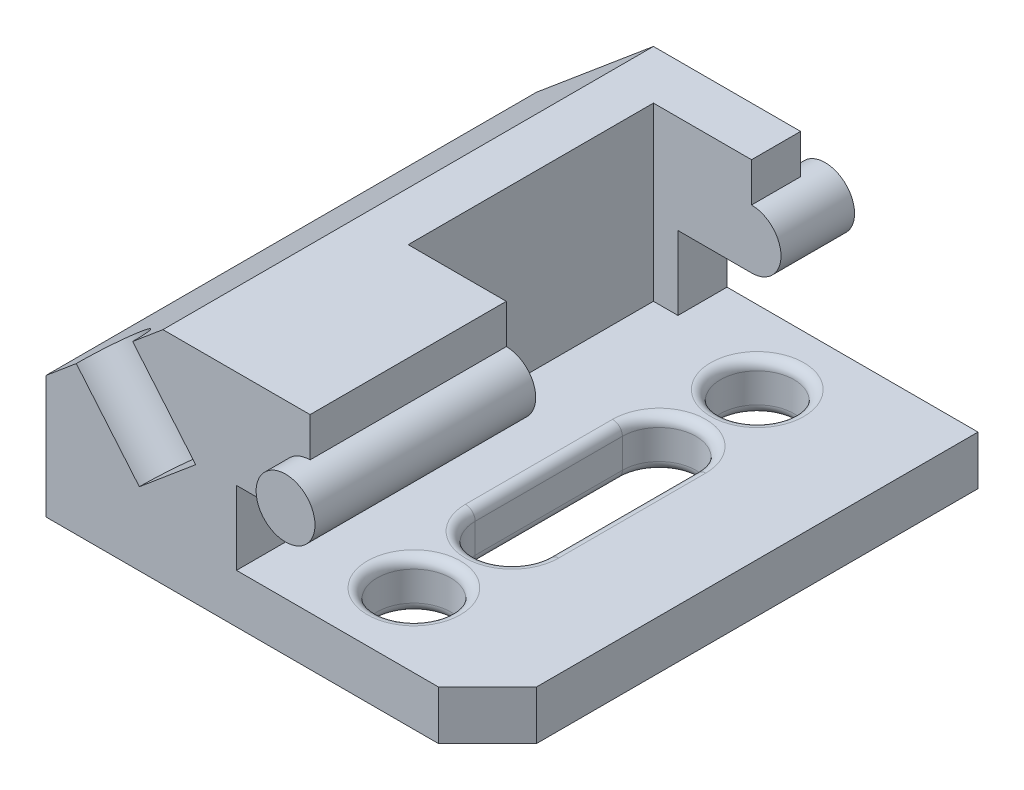
ISO-10303-21;
HEADER;
FILE_DESCRIPTION(('STEP AP214'),'2;1');
FILE_NAME('part.step','',(''),(''),'','','');
FILE_SCHEMA(('AUTOMOTIVE_DESIGN { 1 0 10303 214 1 1 1 1 }'));
ENDSEC;
DATA;
#1=APPLICATION_CONTEXT('core data for automotive mechanical design processes');
#2=APPLICATION_PROTOCOL_DEFINITION('international standard','automotive_design',2000,#1);
#3=PRODUCT_CONTEXT('',#1,'mechanical');
#4=PRODUCT('Part','Part','',(#3));
#5=PRODUCT_RELATED_PRODUCT_CATEGORY('part','',(#4));
#6=PRODUCT_DEFINITION_FORMATION('','',#4);
#7=PRODUCT_DEFINITION_CONTEXT('part definition',#1,'design');
#8=PRODUCT_DEFINITION('design','',#6,#7);
#9=PRODUCT_DEFINITION_SHAPE('','',#8);
#10=(LENGTH_UNIT() NAMED_UNIT(*) SI_UNIT(.MILLI.,.METRE.));
#11=(NAMED_UNIT(*) PLANE_ANGLE_UNIT() SI_UNIT($,.RADIAN.));
#12=(NAMED_UNIT(*) SI_UNIT($,.STERADIAN.) SOLID_ANGLE_UNIT());
#13=UNCERTAINTY_MEASURE_WITH_UNIT(LENGTH_MEASURE(1.E-05),#10,'distance_accuracy_value','');
#14=(GEOMETRIC_REPRESENTATION_CONTEXT(3) GLOBAL_UNCERTAINTY_ASSIGNED_CONTEXT((#13)) GLOBAL_UNIT_ASSIGNED_CONTEXT((#10,
#11,#12)) REPRESENTATION_CONTEXT('',''));
#15=CARTESIAN_POINT('',(0.,0.,0.));
#16=DIRECTION('',(0.,0.,1.));
#17=DIRECTION('',(1.,0.,0.));
#18=AXIS2_PLACEMENT_3D('',#15,#16,#17);
#19=CARTESIAN_POINT('',(38.8350718518843,9.99999999999999,100.));
#20=DIRECTION('',(-1.,0.,0.));
#21=DIRECTION('',(0.,0.,1.));
#22=AXIS2_PLACEMENT_3D('',#19,#20,#21);
#23=PLANE('',#22);
#24=DIRECTION('',(0.,0.,-1.));
#25=VECTOR('',#24,1.);
#26=CARTESIAN_POINT('',(38.8350718518843,9.99999999999999,100.));
#27=LINE('',#26,#25);
#28=CARTESIAN_POINT('',(38.8350718518843,9.99999999999999,100.));
#29=VERTEX_POINT('',#28);
#30=CARTESIAN_POINT('',(38.8350718518843,9.99999999999999,60.));
#31=VERTEX_POINT('',#30);
#32=EDGE_CURVE('E322',#29,#31,#27,.T.);
#33=ORIENTED_EDGE('',*,*,#32,.T.);
#34=DIRECTION('',(0.,1.,0.));
#35=VECTOR('',#34,1.);
#36=CARTESIAN_POINT('',(38.8350718518843,9.99999999999999,60.));
#37=LINE('',#36,#35);
#38=CARTESIAN_POINT('',(38.8350718518843,25.,60.));
#39=VERTEX_POINT('',#38);
#40=EDGE_CURVE('E576',#31,#39,#37,.T.);
#41=ORIENTED_EDGE('',*,*,#40,.T.);
#42=DIRECTION('',(0.,0.,-1.));
#43=VECTOR('',#42,1.);
#44=CARTESIAN_POINT('',(38.8350718518843,25.,100.));
#45=LINE('',#44,#43);
#46=CARTESIAN_POINT('',(38.8350718518843,25.,100.));
#47=VERTEX_POINT('',#46);
#48=EDGE_CURVE('E317',#47,#39,#45,.T.);
#49=ORIENTED_EDGE('',*,*,#48,.F.);
#50=DIRECTION('',(0.,1.,0.));
#51=VECTOR('',#50,1.);
#52=CARTESIAN_POINT('',(38.8350718518843,9.99999999999999,100.));
#53=LINE('',#52,#51);
#54=EDGE_CURVE('E507',#29,#47,#53,.T.);
#55=ORIENTED_EDGE('',*,*,#54,.F.);
#56=EDGE_LOOP('',(#33,#41,#49,#55));
#57=FACE_BOUND('',#56,.T.);
#58=ADVANCED_FACE('F41',(#57),#23,.F.);
#59=CARTESIAN_POINT('',(38.8350718518843,25.,100.));
#60=DIRECTION('',(0.,1.,0.));
#61=DIRECTION('',(0.,0.,1.));
#62=AXIS2_PLACEMENT_3D('',#59,#60,#61);
#63=PLANE('',#62);
#64=ORIENTED_EDGE('',*,*,#48,.T.);
#65=DIRECTION('',(1.,0.,0.));
#66=VECTOR('',#65,1.);
#67=CARTESIAN_POINT('',(38.8350718518843,25.,60.));
#68=LINE('',#67,#66);
#69=CARTESIAN_POINT('',(53.8350718518843,25.,60.));
#70=VERTEX_POINT('',#69);
#71=EDGE_CURVE('E572',#39,#70,#68,.T.);
#72=ORIENTED_EDGE('',*,*,#71,.T.);
#73=DIRECTION('',(0.,0.,-1.));
#74=VECTOR('',#73,1.);
#75=CARTESIAN_POINT('',(53.8350718518843,25.,100.));
#76=LINE('',#75,#74);
#77=CARTESIAN_POINT('',(53.8350718518843,25.,100.));
#78=VERTEX_POINT('',#77);
#79=EDGE_CURVE('E312',#78,#70,#76,.T.);
#80=ORIENTED_EDGE('',*,*,#79,.F.);
#81=DIRECTION('',(1.,0.,0.));
#82=VECTOR('',#81,1.);
#83=CARTESIAN_POINT('',(38.8350718518843,25.,100.));
#84=LINE('',#83,#82);
#85=EDGE_CURVE('E510',#47,#78,#84,.T.);
#86=ORIENTED_EDGE('',*,*,#85,.F.);
#87=EDGE_LOOP('',(#64,#72,#80,#86));
#88=FACE_BOUND('',#87,.T.);
#89=ADVANCED_FACE('F608',(#88),#63,.F.);
#90=CARTESIAN_POINT('',(53.8350718518843,31.,100.));
#91=DIRECTION('',(0.,0.,-1.));
#92=DIRECTION('',(-1.,0.,0.));
#93=AXIS2_PLACEMENT_3D('',#90,#91,#92);
#94=CYLINDRICAL_SURFACE('',#93,6.);
#95=CARTESIAN_POINT('',(53.8350718518843,31.,105.));
#96=DIRECTION('',(0.,0.,1.));
#97=DIRECTION('',(1.,0.,0.));
#98=AXIS2_PLACEMENT_3D('',#95,#96,#97);
#99=CIRCLE('',#98,6.);
#100=CARTESIAN_POINT('',(59.8350718518843,31.,105.));
#101=VERTEX_POINT('',#100);
#102=EDGE_CURVE('E580',#101,#101,#99,.T.);
#103=ORIENTED_EDGE('',*,*,#102,.F.);
#104=EDGE_LOOP('',(#103));
#105=FACE_BOUND('',#104,.T.);
#106=CARTESIAN_POINT('',(53.8350718518843,31.,60.));
#107=DIRECTION('',(0.,0.,1.));
#108=DIRECTION('',(1.,0.,0.));
#109=AXIS2_PLACEMENT_3D('',#106,#107,#108);
#110=CIRCLE('',#109,6.);
#111=CARTESIAN_POINT('',(53.8350718518843,37.,60.));
#112=VERTEX_POINT('',#111);
#113=EDGE_CURVE('E569',#70,#112,#110,.T.);
#114=ORIENTED_EDGE('',*,*,#113,.T.);
#115=DIRECTION('',(0.,0.,-1.));
#116=VECTOR('',#115,1.);
#117=CARTESIAN_POINT('',(53.8350718518843,37.,100.));
#118=LINE('',#117,#116);
#119=CARTESIAN_POINT('',(53.8350718518843,37.,100.));
#120=VERTEX_POINT('',#119);
#121=EDGE_CURVE('E307',#120,#112,#118,.T.);
#122=ORIENTED_EDGE('',*,*,#121,.F.);
#123=CARTESIAN_POINT('',(53.8350718518843,31.,100.));
#124=DIRECTION('',(0.,0.,1.));
#125=DIRECTION('',(1.,0.,0.));
#126=AXIS2_PLACEMENT_3D('',#123,#124,#125);
#127=CIRCLE('',#126,6.);
#128=EDGE_CURVE('E264',#120,#78,#127,.T.);
#129=ORIENTED_EDGE('',*,*,#128,.T.);
#130=ORIENTED_EDGE('',*,*,#79,.T.);
#131=EDGE_LOOP('',(#114,#122,#129,#130));
#132=FACE_BOUND('',#131,.T.);
#133=ADVANCED_FACE('F590',(#105,#132),#94,.T.);
#134=CARTESIAN_POINT('',(53.8350718518843,37.,100.));
#135=DIRECTION('',(-1.,0.,0.));
#136=DIRECTION('',(0.,0.,1.));
#137=AXIS2_PLACEMENT_3D('',#134,#135,#136);
#138=PLANE('',#137);
#139=ORIENTED_EDGE('',*,*,#121,.T.);
#140=DIRECTION('',(0.,1.,0.));
#141=VECTOR('',#140,1.);
#142=CARTESIAN_POINT('',(53.8350718518843,37.,60.));
#143=LINE('',#142,#141);
#144=CARTESIAN_POINT('',(53.8350718518843,45.,60.));
#145=VERTEX_POINT('',#144);
#146=EDGE_CURVE('E522',#112,#145,#143,.T.);
#147=ORIENTED_EDGE('',*,*,#146,.T.);
#148=DIRECTION('',(0.,0.,-1.));
#149=VECTOR('',#148,1.);
#150=CARTESIAN_POINT('',(53.8350718518843,45.,100.));
#151=LINE('',#150,#149);
#152=CARTESIAN_POINT('',(53.8350718518843,45.,100.));
#153=VERTEX_POINT('',#152);
#154=EDGE_CURVE('E302',#153,#145,#151,.T.);
#155=ORIENTED_EDGE('',*,*,#154,.F.);
#156=DIRECTION('',(0.,1.,0.));
#157=VECTOR('',#156,1.);
#158=CARTESIAN_POINT('',(53.8350718518843,37.,100.));
#159=LINE('',#158,#157);
#160=EDGE_CURVE('E255',#120,#153,#159,.T.);
#161=ORIENTED_EDGE('',*,*,#160,.F.);
#162=EDGE_LOOP('',(#139,#147,#155,#161));
#163=FACE_BOUND('',#162,.T.);
#164=ADVANCED_FACE('F520',(#163),#138,.F.);
#165=CARTESIAN_POINT('',(0.,25.,100.));
#166=DIRECTION('',(1.,0.,0.));
#167=DIRECTION('',(0.,1.,0.));
#168=AXIS2_PLACEMENT_3D('',#165,#166,#167);
#169=PLANE('',#168);
#170=DIRECTION('',(0.,-1.,0.));
#171=VECTOR('',#170,1.);
#172=CARTESIAN_POINT('',(0.,25.,0.));
#173=LINE('',#172,#171);
#174=CARTESIAN_POINT('',(0.,25.,0.));
#175=VERTEX_POINT('',#174);
#176=CARTESIAN_POINT('',(0.,0.,0.));
#177=VERTEX_POINT('',#176);
#178=EDGE_CURVE('E259',#175,#177,#173,.T.);
#179=ORIENTED_EDGE('',*,*,#178,.T.);
#180=DIRECTION('',(0.,0.,-1.));
#181=VECTOR('',#180,1.);
#182=CARTESIAN_POINT('',(0.,0.,100.));
#183=LINE('',#182,#181);
#184=CARTESIAN_POINT('',(0.,0.,100.));
#185=VERTEX_POINT('',#184);
#186=EDGE_CURVE('E332',#185,#177,#183,.T.);
#187=ORIENTED_EDGE('',*,*,#186,.F.);
#188=DIRECTION('',(0.,-1.,0.));
#189=VECTOR('',#188,1.);
#190=CARTESIAN_POINT('',(0.,25.,100.));
#191=LINE('',#190,#189);
#192=CARTESIAN_POINT('',(0.,25.,100.));
#193=VERTEX_POINT('',#192);
#194=EDGE_CURVE('E294',#193,#185,#191,.T.);
#195=ORIENTED_EDGE('',*,*,#194,.F.);
#196=DIRECTION('',(0.,0.,-1.));
#197=VECTOR('',#196,1.);
#198=CARTESIAN_POINT('',(0.,25.,100.));
#199=LINE('',#198,#197);
#200=EDGE_CURVE('E247',#193,#175,#199,.T.);
#201=ORIENTED_EDGE('',*,*,#200,.T.);
#202=EDGE_LOOP('',(#179,#187,#195,#201));
#203=FACE_BOUND('',#202,.T.);
#204=ADVANCED_FACE('F493',(#203),#169,.F.);
#205=CARTESIAN_POINT('',(0.,0.,100.));
#206=DIRECTION('',(0.,1.,0.));
#207=DIRECTION('',(0.,0.,1.));
#208=AXIS2_PLACEMENT_3D('',#205,#206,#207);
#209=PLANE('',#208);
#210=DIRECTION('',(0.,0.,-1.));
#211=VECTOR('',#210,1.);
#212=CARTESIAN_POINT('',(69.5,0.,100.));
#213=LINE('',#212,#211);
#214=CARTESIAN_POINT('',(69.5,0.,65.));
#215=VERTEX_POINT('',#214);
#216=CARTESIAN_POINT('',(69.5,0.,35.));
#217=VERTEX_POINT('',#216);
#218=EDGE_CURVE('E371',#215,#217,#213,.T.);
#219=ORIENTED_EDGE('',*,*,#218,.T.);
#220=CARTESIAN_POINT('',(60.,0.,35.));
#221=DIRECTION('',(0.,1.,0.));
#222=DIRECTION('',(0.,0.,1.));
#223=AXIS2_PLACEMENT_3D('',#220,#221,#222);
#224=CIRCLE('',#223,9.5);
#225=CARTESIAN_POINT('',(50.5,0.,35.));
#226=VERTEX_POINT('',#225);
#227=EDGE_CURVE('E374',#217,#226,#224,.T.);
#228=ORIENTED_EDGE('',*,*,#227,.T.);
#229=DIRECTION('',(0.,0.,1.));
#230=VECTOR('',#229,1.);
#231=CARTESIAN_POINT('',(50.5,0.,100.));
#232=LINE('',#231,#230);
#233=CARTESIAN_POINT('',(50.5,0.,65.));
#234=VERTEX_POINT('',#233);
#235=EDGE_CURVE('E365',#226,#234,#232,.T.);
#236=ORIENTED_EDGE('',*,*,#235,.T.);
#237=CARTESIAN_POINT('',(60.,0.,65.));
#238=DIRECTION('',(0.,1.,0.));
#239=DIRECTION('',(0.,0.,1.));
#240=AXIS2_PLACEMENT_3D('',#237,#238,#239);
#241=CIRCLE('',#240,9.5);
#242=EDGE_CURVE('E368',#234,#215,#241,.T.);
#243=ORIENTED_EDGE('',*,*,#242,.T.);
#244=EDGE_LOOP('',(#219,#228,#236,#243));
#245=FACE_BOUND('',#244,.T.);
#246=CARTESIAN_POINT('',(60.,0.,85.));
#247=DIRECTION('',(0.,1.,0.));
#248=DIRECTION('',(0.,0.,1.));
#249=AXIS2_PLACEMENT_3D('',#246,#247,#248);
#250=CIRCLE('',#249,9.50000000000002);
#251=CARTESIAN_POINT('',(60.,0.,94.5));
#252=VERTEX_POINT('',#251);
#253=EDGE_CURVE('E361',#252,#252,#250,.T.);
#254=ORIENTED_EDGE('',*,*,#253,.T.);
#255=EDGE_LOOP('',(#254));
#256=FACE_BOUND('',#255,.T.);
#257=CARTESIAN_POINT('',(60.,0.,15.));
#258=DIRECTION('',(0.,1.,0.));
#259=DIRECTION('',(0.,0.,1.));
#260=AXIS2_PLACEMENT_3D('',#257,#258,#259);
#261=CIRCLE('',#260,9.5);
#262=CARTESIAN_POINT('',(60.,0.,24.5));
#263=VERTEX_POINT('',#262);
#264=EDGE_CURVE('E357',#263,#263,#261,.T.);
#265=ORIENTED_EDGE('',*,*,#264,.T.);
#266=EDGE_LOOP('',(#265));
#267=FACE_BOUND('',#266,.T.);
#268=DIRECTION('',(0.,0.,-1.));
#269=VECTOR('',#268,1.);
#270=CARTESIAN_POINT('',(90.,0.,100.));
#271=LINE('',#270,#269);
#272=CARTESIAN_POINT('',(90.,0.,90.));
#273=VERTEX_POINT('',#272);
#274=CARTESIAN_POINT('',(90.,0.,0.));
#275=VERTEX_POINT('',#274);
#276=EDGE_CURVE('E329',#273,#275,#271,.T.);
#277=ORIENTED_EDGE('',*,*,#276,.F.);
#278=DIRECTION('',(-0.707106781186546,0.,0.707106781186549));
#279=VECTOR('',#278,1.);
#280=CARTESIAN_POINT('',(80.,0.,100.));
#281=LINE('',#280,#279);
#282=CARTESIAN_POINT('',(80.,0.,100.));
#283=VERTEX_POINT('',#282);
#284=EDGE_CURVE('E346',#273,#283,#281,.T.);
#285=ORIENTED_EDGE('',*,*,#284,.T.);
#286=DIRECTION('',(1.,0.,0.));
#287=VECTOR('',#286,1.);
#288=CARTESIAN_POINT('',(0.,0.,100.));
#289=LINE('',#288,#287);
#290=EDGE_CURVE('E497',#185,#283,#289,.T.);
#291=ORIENTED_EDGE('',*,*,#290,.F.);
#292=ORIENTED_EDGE('',*,*,#186,.T.);
#293=DIRECTION('',(1.,0.,0.));
#294=VECTOR('',#293,1.);
#295=CARTESIAN_POINT('',(0.,0.,0.));
#296=LINE('',#295,#294);
#297=EDGE_CURVE('E263',#177,#275,#296,.T.);
#298=ORIENTED_EDGE('',*,*,#297,.T.);
#299=EDGE_LOOP('',(#277,#285,#291,#292,#298));
#300=FACE_BOUND('',#299,.T.);
#301=ADVANCED_FACE('F651',(#245,#256,#267,#300),#209,.F.);
#302=CARTESIAN_POINT('',(90.,0.,100.));
#303=DIRECTION('',(-1.,0.,0.));
#304=DIRECTION('',(0.,0.,1.));
#305=AXIS2_PLACEMENT_3D('',#302,#303,#304);
#306=PLANE('',#305);
#307=DIRECTION('',(0.,0.,-1.));
#308=VECTOR('',#307,1.);
#309=CARTESIAN_POINT('',(90.,10.,100.));
#310=LINE('',#309,#308);
#311=CARTESIAN_POINT('',(90.,10.,90.));
#312=VERTEX_POINT('',#311);
#313=CARTESIAN_POINT('',(90.,10.,0.));
#314=VERTEX_POINT('',#313);
#315=EDGE_CURVE('E326',#312,#314,#310,.T.);
#316=ORIENTED_EDGE('',*,*,#315,.F.);
#317=DIRECTION('',(0.,-1.,0.));
#318=VECTOR('',#317,1.);
#319=CARTESIAN_POINT('',(90.,0.,90.));
#320=LINE('',#319,#318);
#321=EDGE_CURVE('E343',#312,#273,#320,.T.);
#322=ORIENTED_EDGE('',*,*,#321,.T.);
#323=ORIENTED_EDGE('',*,*,#276,.T.);
#324=DIRECTION('',(0.,1.,0.));
#325=VECTOR('',#324,1.);
#326=CARTESIAN_POINT('',(90.,0.,0.));
#327=LINE('',#326,#325);
#328=EDGE_CURVE('E268',#275,#314,#327,.T.);
#329=ORIENTED_EDGE('',*,*,#328,.T.);
#330=EDGE_LOOP('',(#316,#322,#323,#329));
#331=FACE_BOUND('',#330,.T.);
#332=ADVANCED_FACE('F628',(#331),#306,.F.);
#333=CARTESIAN_POINT('',(90.,10.,100.));
#334=DIRECTION('',(0.,-1.,0.));
#335=DIRECTION('',(1.,0.,0.));
#336=AXIS2_PLACEMENT_3D('',#333,#334,#335);
#337=PLANE('',#336);
#338=DIRECTION('',(0.,0.,1.));
#339=VECTOR('',#338,1.);
#340=CARTESIAN_POINT('',(50.5,9.99999999999999,100.));
#341=LINE('',#340,#339);
#342=CARTESIAN_POINT('',(50.5,9.99999999999999,65.));
#343=VERTEX_POINT('',#342);
#344=CARTESIAN_POINT('',(50.5,9.99999999999999,35.));
#345=VERTEX_POINT('',#344);
#346=EDGE_CURVE('E394',#343,#345,#341,.F.);
#347=ORIENTED_EDGE('',*,*,#346,.T.);
#348=CARTESIAN_POINT('',(60.,9.99999999999999,35.));
#349=DIRECTION('',(0.,-1.,0.));
#350=DIRECTION('',(1.,0.,0.));
#351=AXIS2_PLACEMENT_3D('',#348,#349,#350);
#352=CIRCLE('',#351,9.5);
#353=CARTESIAN_POINT('',(69.5,10.,35.));
#354=VERTEX_POINT('',#353);
#355=EDGE_CURVE('E403',#345,#354,#352,.T.);
#356=ORIENTED_EDGE('',*,*,#355,.T.);
#357=DIRECTION('',(0.,0.,-1.));
#358=VECTOR('',#357,1.);
#359=CARTESIAN_POINT('',(69.5,10.,100.));
#360=LINE('',#359,#358);
#361=CARTESIAN_POINT('',(69.5,10.,65.));
#362=VERTEX_POINT('',#361);
#363=EDGE_CURVE('E400',#354,#362,#360,.F.);
#364=ORIENTED_EDGE('',*,*,#363,.T.);
#365=CARTESIAN_POINT('',(60.,9.99999999999999,65.));
#366=DIRECTION('',(0.,-1.,0.));
#367=DIRECTION('',(1.,0.,0.));
#368=AXIS2_PLACEMENT_3D('',#365,#366,#367);
#369=CIRCLE('',#368,9.5);
#370=EDGE_CURVE('E397',#362,#343,#369,.T.);
#371=ORIENTED_EDGE('',*,*,#370,.T.);
#372=EDGE_LOOP('',(#347,#356,#364,#371));
#373=FACE_BOUND('',#372,.T.);
#374=CARTESIAN_POINT('',(60.,9.99999999999999,85.));
#375=DIRECTION('',(0.,-1.,0.));
#376=DIRECTION('',(1.,0.,0.));
#377=AXIS2_PLACEMENT_3D('',#374,#375,#376);
#378=CIRCLE('',#377,9.50000000000002);
#379=CARTESIAN_POINT('',(69.5,10.,85.));
#380=VERTEX_POINT('',#379);
#381=EDGE_CURVE('E390',#380,#380,#378,.T.);
#382=ORIENTED_EDGE('',*,*,#381,.T.);
#383=EDGE_LOOP('',(#382));
#384=FACE_BOUND('',#383,.T.);
#385=CARTESIAN_POINT('',(60.,9.99999999999999,15.));
#386=DIRECTION('',(0.,-1.,0.));
#387=DIRECTION('',(1.,0.,0.));
#388=AXIS2_PLACEMENT_3D('',#385,#386,#387);
#389=CIRCLE('',#388,9.5);
#390=CARTESIAN_POINT('',(69.5,10.,15.));
#391=VERTEX_POINT('',#390);
#392=EDGE_CURVE('E386',#391,#391,#389,.T.);
#393=ORIENTED_EDGE('',*,*,#392,.T.);
#394=EDGE_LOOP('',(#393));
#395=FACE_BOUND('',#394,.T.);
#396=DIRECTION('',(1.,0.,0.));
#397=VECTOR('',#396,1.);
#398=CARTESIAN_POINT('',(33.8350718518843,9.99999999999999,60.));
#399=LINE('',#398,#397);
#400=CARTESIAN_POINT('',(33.8350718518843,9.99999999999999,60.));
#401=VERTEX_POINT('',#400);
#402=EDGE_CURVE('E529',#401,#31,#399,.T.);
#403=ORIENTED_EDGE('',*,*,#402,.T.);
#404=ORIENTED_EDGE('',*,*,#32,.F.);
#405=DIRECTION('',(-1.,0.,0.));
#406=VECTOR('',#405,1.);
#407=CARTESIAN_POINT('',(90.,10.,100.));
#408=LINE('',#407,#406);
#409=CARTESIAN_POINT('',(80.,10.,100.));
#410=VERTEX_POINT('',#409);
#411=EDGE_CURVE('E500',#410,#29,#408,.T.);
#412=ORIENTED_EDGE('',*,*,#411,.F.);
#413=DIRECTION('',(0.707106781186546,0.,-0.707106781186549));
#414=VECTOR('',#413,1.);
#415=CARTESIAN_POINT('',(80.,10.,100.));
#416=LINE('',#415,#414);
#417=EDGE_CURVE('E340',#410,#312,#416,.T.);
#418=ORIENTED_EDGE('',*,*,#417,.T.);
#419=ORIENTED_EDGE('',*,*,#315,.T.);
#420=DIRECTION('',(-1.,0.,0.));
#421=VECTOR('',#420,1.);
#422=CARTESIAN_POINT('',(90.,10.,0.));
#423=LINE('',#422,#421);
#424=CARTESIAN_POINT('',(38.8350718518843,9.99999999999999,0.));
#425=VERTEX_POINT('',#424);
#426=EDGE_CURVE('E272',#314,#425,#423,.T.);
#427=ORIENTED_EDGE('',*,*,#426,.T.);
#428=CARTESIAN_POINT('',(38.8350718518843,9.99999999999999,10.));
#429=VERTEX_POINT('',#428);
#430=EDGE_CURVE('E321',#429,#425,#27,.T.);
#431=ORIENTED_EDGE('',*,*,#430,.F.);
#432=DIRECTION('',(-1.,0.,0.));
#433=VECTOR('',#432,1.);
#434=CARTESIAN_POINT('',(33.8350718518843,9.99999999999999,10.));
#435=LINE('',#434,#433);
#436=CARTESIAN_POINT('',(33.8350718518843,9.99999999999999,10.));
#437=VERTEX_POINT('',#436);
#438=EDGE_CURVE('E534',#429,#437,#435,.T.);
#439=ORIENTED_EDGE('',*,*,#438,.T.);
#440=DIRECTION('',(0.,0.,1.));
#441=VECTOR('',#440,1.);
#442=CARTESIAN_POINT('',(33.8350718518843,9.99999999999999,10.));
#443=LINE('',#442,#441);
#444=EDGE_CURVE('E541',#437,#401,#443,.T.);
#445=ORIENTED_EDGE('',*,*,#444,.T.);
#446=EDGE_LOOP('',(#403,#404,#412,#418,#419,#427,#431,#439,#445));
#447=FACE_BOUND('',#446,.T.);
#448=ADVANCED_FACE('F620',(#373,#384,#395,#447),#337,.F.);
#449=CARTESIAN_POINT('',(38.8350718518843,25.,10.));
#450=VERTEX_POINT('',#449);
#451=CARTESIAN_POINT('',(38.8350718518843,25.,0.));
#452=VERTEX_POINT('',#451);
#453=EDGE_CURVE('E316',#450,#452,#45,.T.);
#454=ORIENTED_EDGE('',*,*,#453,.F.);
#455=DIRECTION('',(0.,-1.,0.));
#456=VECTOR('',#455,1.);
#457=CARTESIAN_POINT('',(38.8350718518843,9.99999999999999,9.99999999999999));
#458=LINE('',#457,#456);
#459=EDGE_CURVE('E563',#450,#429,#458,.T.);
#460=ORIENTED_EDGE('',*,*,#459,.T.);
#461=ORIENTED_EDGE('',*,*,#430,.T.);
#462=DIRECTION('',(0.,1.,0.));
#463=VECTOR('',#462,1.);
#464=CARTESIAN_POINT('',(38.8350718518843,9.99999999999999,0.));
#465=LINE('',#464,#463);
#466=EDGE_CURVE('E276',#425,#452,#465,.T.);
#467=ORIENTED_EDGE('',*,*,#466,.T.);
#468=EDGE_LOOP('',(#454,#460,#461,#467));
#469=FACE_BOUND('',#468,.T.);
#470=ADVANCED_FACE('F611',(#469),#23,.F.);
#471=CARTESIAN_POINT('',(53.8350718518843,25.,10.));
#472=VERTEX_POINT('',#471);
#473=CARTESIAN_POINT('',(53.8350718518843,25.,0.));
#474=VERTEX_POINT('',#473);
#475=EDGE_CURVE('E311',#472,#474,#76,.T.);
#476=ORIENTED_EDGE('',*,*,#475,.F.);
#477=DIRECTION('',(-1.,0.,0.));
#478=VECTOR('',#477,1.);
#479=CARTESIAN_POINT('',(38.8350718518843,25.,10.));
#480=LINE('',#479,#478);
#481=EDGE_CURVE('E559',#472,#450,#480,.T.);
#482=ORIENTED_EDGE('',*,*,#481,.T.);
#483=ORIENTED_EDGE('',*,*,#453,.T.);
#484=DIRECTION('',(1.,0.,0.));
#485=VECTOR('',#484,1.);
#486=CARTESIAN_POINT('',(38.8350718518843,25.,0.));
#487=LINE('',#486,#485);
#488=EDGE_CURVE('E280',#452,#474,#487,.T.);
#489=ORIENTED_EDGE('',*,*,#488,.T.);
#490=EDGE_LOOP('',(#476,#482,#483,#489));
#491=FACE_BOUND('',#490,.T.);
#492=ADVANCED_FACE('F617',(#491),#63,.F.);
#493=CARTESIAN_POINT('',(53.8350718518843,31.,10.));
#494=DIRECTION('',(0.,0.,-1.));
#495=DIRECTION('',(-1.,0.,0.));
#496=AXIS2_PLACEMENT_3D('',#493,#494,#495);
#497=CIRCLE('',#496,6.);
#498=CARTESIAN_POINT('',(53.8350718518843,37.,10.));
#499=VERTEX_POINT('',#498);
#500=EDGE_CURVE('E556',#499,#472,#497,.T.);
#501=ORIENTED_EDGE('',*,*,#500,.T.);
#502=ORIENTED_EDGE('',*,*,#475,.T.);
#503=CARTESIAN_POINT('',(53.8350718518843,31.,0.));
#504=DIRECTION('',(0.,0.,1.));
#505=DIRECTION('',(1.,0.,0.));
#506=AXIS2_PLACEMENT_3D('',#503,#504,#505);
#507=CIRCLE('',#506,6.);
#508=CARTESIAN_POINT('',(53.8350718518843,37.,0.));
#509=VERTEX_POINT('',#508);
#510=EDGE_CURVE('E349',#509,#474,#507,.T.);
#511=ORIENTED_EDGE('',*,*,#510,.F.);
#512=EDGE_CURVE('E306',#499,#509,#118,.T.);
#513=ORIENTED_EDGE('',*,*,#512,.F.);
#514=EDGE_LOOP('',(#501,#502,#511,#513));
#515=FACE_BOUND('',#514,.T.);
#516=CARTESIAN_POINT('',(53.8350718518843,31.,-5.));
#517=DIRECTION('',(0.,0.,1.));
#518=DIRECTION('',(1.,0.,0.));
#519=AXIS2_PLACEMENT_3D('',#516,#517,#518);
#520=CIRCLE('',#519,6.);
#521=CARTESIAN_POINT('',(59.8350718518843,31.,-5.));
#522=VERTEX_POINT('',#521);
#523=EDGE_CURVE('E583',#522,#522,#520,.T.);
#524=ORIENTED_EDGE('',*,*,#523,.T.);
#525=EDGE_LOOP('',(#524));
#526=FACE_BOUND('',#525,.T.);
#527=ADVANCED_FACE('F626',(#515,#526),#94,.T.);
#528=CARTESIAN_POINT('',(53.8350718518843,45.,10.));
#529=VERTEX_POINT('',#528);
#530=CARTESIAN_POINT('',(53.8350718518843,45.,0.));
#531=VERTEX_POINT('',#530);
#532=EDGE_CURVE('E301',#529,#531,#151,.T.);
#533=ORIENTED_EDGE('',*,*,#532,.F.);
#534=DIRECTION('',(0.,-1.,0.));
#535=VECTOR('',#534,1.);
#536=CARTESIAN_POINT('',(53.8350718518843,37.,10.));
#537=LINE('',#536,#535);
#538=EDGE_CURVE('E553',#529,#499,#537,.T.);
#539=ORIENTED_EDGE('',*,*,#538,.T.);
#540=ORIENTED_EDGE('',*,*,#512,.T.);
#541=DIRECTION('',(0.,1.,0.));
#542=VECTOR('',#541,1.);
#543=CARTESIAN_POINT('',(53.8350718518843,37.,0.));
#544=LINE('',#543,#542);
#545=EDGE_CURVE('E284',#509,#531,#544,.T.);
#546=ORIENTED_EDGE('',*,*,#545,.T.);
#547=EDGE_LOOP('',(#533,#539,#540,#546));
#548=FACE_BOUND('',#547,.T.);
#549=ADVANCED_FACE('F485',(#548),#138,.F.);
#550=CARTESIAN_POINT('',(53.8350718518843,45.,100.));
#551=DIRECTION('',(0.,-1.,0.));
#552=DIRECTION('',(0.,0.,-1.));
#553=AXIS2_PLACEMENT_3D('',#550,#551,#552);
#554=PLANE('',#553);
#555=ORIENTED_EDGE('',*,*,#154,.T.);
#556=DIRECTION('',(1.,0.,0.));
#557=VECTOR('',#556,1.);
#558=CARTESIAN_POINT('',(33.8350718518843,45.,60.));
#559=LINE('',#558,#557);
#560=CARTESIAN_POINT('',(33.8350718518843,45.,60.));
#561=VERTEX_POINT('',#560);
#562=EDGE_CURVE('E524',#561,#145,#559,.T.);
#563=ORIENTED_EDGE('',*,*,#562,.F.);
#564=DIRECTION('',(0.,0.,1.));
#565=VECTOR('',#564,1.);
#566=CARTESIAN_POINT('',(33.8350718518843,45.,10.));
#567=LINE('',#566,#565);
#568=CARTESIAN_POINT('',(33.8350718518843,45.,9.99999999999999));
#569=VERTEX_POINT('',#568);
#570=EDGE_CURVE('E526',#569,#561,#567,.T.);
#571=ORIENTED_EDGE('',*,*,#570,.F.);
#572=DIRECTION('',(1.,0.,0.));
#573=VECTOR('',#572,1.);
#574=CARTESIAN_POINT('',(53.8350718518843,45.,10.));
#575=LINE('',#574,#573);
#576=EDGE_CURVE('E353',#569,#529,#575,.T.);
#577=ORIENTED_EDGE('',*,*,#576,.T.);
#578=ORIENTED_EDGE('',*,*,#532,.T.);
#579=DIRECTION('',(-1.,0.,0.));
#580=VECTOR('',#579,1.);
#581=CARTESIAN_POINT('',(53.8350718518843,45.,0.));
#582=LINE('',#581,#580);
#583=CARTESIAN_POINT('',(23.8350718518843,45.,0.));
#584=VERTEX_POINT('',#583);
#585=EDGE_CURVE('E288',#531,#584,#582,.T.);
#586=ORIENTED_EDGE('',*,*,#585,.T.);
#587=DIRECTION('',(0.,0.,-1.));
#588=VECTOR('',#587,1.);
#589=CARTESIAN_POINT('',(23.8350718518843,45.,100.));
#590=LINE('',#589,#588);
#591=CARTESIAN_POINT('',(23.8350718518843,45.,100.));
#592=VERTEX_POINT('',#591);
#593=EDGE_CURVE('E297',#592,#584,#590,.T.);
#594=ORIENTED_EDGE('',*,*,#593,.F.);
#595=DIRECTION('',(-1.,0.,0.));
#596=VECTOR('',#595,1.);
#597=CARTESIAN_POINT('',(53.8350718518843,45.,100.));
#598=LINE('',#597,#596);
#599=EDGE_CURVE('E251',#153,#592,#598,.T.);
#600=ORIENTED_EDGE('',*,*,#599,.F.);
#601=EDGE_LOOP('',(#555,#563,#571,#577,#578,#586,#594,#600));
#602=FACE_BOUND('',#601,.T.);
#603=ADVANCED_FACE('F477',(#602),#554,.F.);
#604=CARTESIAN_POINT('',(23.8350718518843,45.,100.));
#605=DIRECTION('',(0.642787609686538,-0.766044443118979,0.));
#606=DIRECTION('',(0.766044443118979,0.642787609686538,0.));
#607=AXIS2_PLACEMENT_3D('',#604,#605,#606);
#608=PLANE('',#607);
#609=DIRECTION('',(-0.766044443118979,-0.642787609686538,0.));
#610=VECTOR('',#609,1.);
#611=CARTESIAN_POINT('',(23.8350718518843,45.,100.));
#612=LINE('',#611,#610);
#613=CARTESIAN_POINT('',(6.17220260254979,30.179092927351,100.));
#614=VERTEX_POINT('',#613);
#615=EDGE_CURVE('E241',#614,#193,#612,.T.);
#616=ORIENTED_EDGE('',*,*,#615,.F.);
#617=CARTESIAN_POINT('',(11.9175359259421,35.,100.));
#618=DIRECTION('',(-0.642787609686538,0.766044443118979,0.));
#619=DIRECTION('',(-0.766044443118979,-0.642787609686538,0.));
#620=AXIS2_PLACEMENT_3D('',#617,#618,#619);
#621=CIRCLE('',#620,7.5);
#622=CARTESIAN_POINT('',(17.6628692493345,39.8209070726491,100.));
#623=VERTEX_POINT('',#622);
#624=EDGE_CURVE('E227',#623,#614,#621,.T.);
#625=ORIENTED_EDGE('',*,*,#624,.F.);
#626=EDGE_CURVE('E250',#592,#623,#612,.T.);
#627=ORIENTED_EDGE('',*,*,#626,.F.);
#628=ORIENTED_EDGE('',*,*,#593,.T.);
#629=DIRECTION('',(-0.766044443118979,-0.642787609686538,0.));
#630=VECTOR('',#629,1.);
#631=CARTESIAN_POINT('',(23.8350718518843,45.,0.));
#632=LINE('',#631,#630);
#633=EDGE_CURVE('E291',#584,#175,#632,.T.);
#634=ORIENTED_EDGE('',*,*,#633,.T.);
#635=ORIENTED_EDGE('',*,*,#200,.F.);
#636=EDGE_LOOP('',(#616,#625,#627,#628,#634,#635));
#637=FACE_BOUND('',#636,.T.);
#638=ADVANCED_FACE('F245',(#637),#608,.F.);
#639=CARTESIAN_POINT('',(53.8350718518843,31.,100.));
#640=DIRECTION('',(0.,0.,1.));
#641=DIRECTION('',(1.,0.,0.));
#642=AXIS2_PLACEMENT_3D('',#639,#640,#641);
#643=PLANE('',#642);
#644=DIRECTION('',(-0.642787609686538,0.766044443118979,0.));
#645=VECTOR('',#644,1.);
#646=CARTESIAN_POINT('',(30.5186214430652,24.5000182102695,100.));
#647=LINE('',#646,#645);
#648=CARTESIAN_POINT('',(30.5186214430652,24.5000182102695,100.));
#649=VERTEX_POINT('',#648);
#650=EDGE_CURVE('E11',#649,#623,#647,.T.);
#651=ORIENTED_EDGE('',*,*,#650,.F.);
#652=DIRECTION('',(-0.766044443118979,-0.642787609686538,0.));
#653=VECTOR('',#652,1.);
#654=CARTESIAN_POINT('',(47.4018924395336,38.6667646764721,100.));
#655=LINE('',#654,#653);
#656=CARTESIAN_POINT('',(19.0279547962806,14.8582040649714,100.));
#657=VERTEX_POINT('',#656);
#658=EDGE_CURVE('E243',#649,#657,#655,.T.);
#659=ORIENTED_EDGE('',*,*,#658,.T.);
#660=DIRECTION('',(-0.642787609686538,0.766044443118979,0.));
#661=VECTOR('',#660,1.);
#662=CARTESIAN_POINT('',(19.0279547962806,14.8582040649714,100.));
#663=LINE('',#662,#661);
#664=EDGE_CURVE('E50',#614,#657,#663,.F.);
#665=ORIENTED_EDGE('',*,*,#664,.F.);
#666=ORIENTED_EDGE('',*,*,#615,.T.);
#667=ORIENTED_EDGE('',*,*,#194,.T.);
#668=ORIENTED_EDGE('',*,*,#290,.T.);
#669=DIRECTION('',(0.,1.,0.));
#670=VECTOR('',#669,1.);
#671=CARTESIAN_POINT('',(80.,10.,100.));
#672=LINE('',#671,#670);
#673=EDGE_CURVE('E336',#283,#410,#672,.T.);
#674=ORIENTED_EDGE('',*,*,#673,.T.);
#675=ORIENTED_EDGE('',*,*,#411,.T.);
#676=ORIENTED_EDGE('',*,*,#54,.T.);
#677=ORIENTED_EDGE('',*,*,#85,.T.);
#678=ORIENTED_EDGE('',*,*,#128,.F.);
#679=ORIENTED_EDGE('',*,*,#160,.T.);
#680=ORIENTED_EDGE('',*,*,#599,.T.);
#681=ORIENTED_EDGE('',*,*,#626,.T.);
#682=EDGE_LOOP('',(#651,#659,#665,#666,#667,#668,#674,#675,#676,#677,#678,#679,#680,#681));
#683=FACE_BOUND('',#682,.T.);
#684=ADVANCED_FACE('F239',(#683),#643,.T.);
#685=CARTESIAN_POINT('',(53.8350718518843,31.,0.));
#686=DIRECTION('',(0.,0.,1.));
#687=DIRECTION('',(1.,0.,0.));
#688=AXIS2_PLACEMENT_3D('',#685,#686,#687);
#689=PLANE('',#688);
#690=ORIENTED_EDGE('',*,*,#545,.F.);
#691=ORIENTED_EDGE('',*,*,#510,.T.);
#692=ORIENTED_EDGE('',*,*,#488,.F.);
#693=ORIENTED_EDGE('',*,*,#466,.F.);
#694=ORIENTED_EDGE('',*,*,#426,.F.);
#695=ORIENTED_EDGE('',*,*,#328,.F.);
#696=ORIENTED_EDGE('',*,*,#297,.F.);
#697=ORIENTED_EDGE('',*,*,#178,.F.);
#698=ORIENTED_EDGE('',*,*,#633,.F.);
#699=ORIENTED_EDGE('',*,*,#585,.F.);
#700=EDGE_LOOP('',(#690,#691,#692,#693,#694,#695,#696,#697,#698,#699));
#701=FACE_BOUND('',#700,.T.);
#702=ADVANCED_FACE('F490',(#701),#689,.F.);
#703=CARTESIAN_POINT('',(80.,31.,100.));
#704=DIRECTION('',(0.707106781186549,0.,0.707106781186546));
#705=DIRECTION('',(0.,-1.,0.));
#706=AXIS2_PLACEMENT_3D('',#703,#704,#705);
#707=PLANE('',#706);
#708=ORIENTED_EDGE('',*,*,#284,.F.);
#709=ORIENTED_EDGE('',*,*,#321,.F.);
#710=ORIENTED_EDGE('',*,*,#417,.F.);
#711=ORIENTED_EDGE('',*,*,#673,.F.);
#712=EDGE_LOOP('',(#708,#709,#710,#711));
#713=FACE_BOUND('',#712,.T.);
#714=ADVANCED_FACE('F654',(#713),#707,.T.);
#715=CARTESIAN_POINT('',(53.8350718518843,31.,-5.));
#716=DIRECTION('',(0.,0.,1.));
#717=DIRECTION('',(1.,0.,0.));
#718=AXIS2_PLACEMENT_3D('',#715,#716,#717);
#719=PLANE('',#718);
#720=ORIENTED_EDGE('',*,*,#523,.F.);
#721=EDGE_LOOP('',(#720));
#722=FACE_BOUND('',#721,.T.);
#723=ADVANCED_FACE('F604',(#722),#719,.F.);
#724=CARTESIAN_POINT('',(53.8350718518843,31.,105.));
#725=DIRECTION('',(0.,0.,1.));
#726=DIRECTION('',(1.,0.,0.));
#727=AXIS2_PLACEMENT_3D('',#724,#725,#726);
#728=PLANE('',#727);
#729=ORIENTED_EDGE('',*,*,#102,.T.);
#730=EDGE_LOOP('',(#729));
#731=FACE_BOUND('',#730,.T.);
#732=ADVANCED_FACE('F595',(#731),#728,.T.);
#733=CARTESIAN_POINT('',(33.8350718518843,-46.3560112144215,60.));
#734=DIRECTION('',(0.,0.,1.));
#735=DIRECTION('',(1.,0.,0.));
#736=AXIS2_PLACEMENT_3D('',#733,#734,#735);
#737=PLANE('',#736);
#738=ORIENTED_EDGE('',*,*,#402,.F.);
#739=DIRECTION('',(0.,1.,0.));
#740=VECTOR('',#739,1.);
#741=CARTESIAN_POINT('',(33.8350718518843,-46.3560112144215,60.));
#742=LINE('',#741,#740);
#743=EDGE_CURVE('E545',#401,#561,#742,.T.);
#744=ORIENTED_EDGE('',*,*,#743,.T.);
#745=ORIENTED_EDGE('',*,*,#562,.T.);
#746=ORIENTED_EDGE('',*,*,#146,.F.);
#747=ORIENTED_EDGE('',*,*,#113,.F.);
#748=ORIENTED_EDGE('',*,*,#71,.F.);
#749=ORIENTED_EDGE('',*,*,#40,.F.);
#750=EDGE_LOOP('',(#738,#744,#745,#746,#747,#748,#749));
#751=FACE_BOUND('',#750,.T.);
#752=ADVANCED_FACE('F592',(#751),#737,.F.);
#753=CARTESIAN_POINT('',(33.8350718518843,-46.3560112144215,10.));
#754=DIRECTION('',(0.,0.,-1.));
#755=DIRECTION('',(-1.,0.,0.));
#756=AXIS2_PLACEMENT_3D('',#753,#754,#755);
#757=PLANE('',#756);
#758=ORIENTED_EDGE('',*,*,#481,.F.);
#759=ORIENTED_EDGE('',*,*,#500,.F.);
#760=ORIENTED_EDGE('',*,*,#538,.F.);
#761=ORIENTED_EDGE('',*,*,#576,.F.);
#762=DIRECTION('',(0.,1.,0.));
#763=VECTOR('',#762,1.);
#764=CARTESIAN_POINT('',(33.8350718518843,-46.3560112144215,10.));
#765=LINE('',#764,#763);
#766=EDGE_CURVE('E546',#437,#569,#765,.T.);
#767=ORIENTED_EDGE('',*,*,#766,.F.);
#768=ORIENTED_EDGE('',*,*,#438,.F.);
#769=ORIENTED_EDGE('',*,*,#459,.F.);
#770=EDGE_LOOP('',(#758,#759,#760,#761,#767,#768,#769));
#771=FACE_BOUND('',#770,.T.);
#772=ADVANCED_FACE('F594',(#771),#757,.F.);
#773=CARTESIAN_POINT('',(33.8350718518843,-46.3560112144215,10.));
#774=DIRECTION('',(-1.,0.,0.));
#775=DIRECTION('',(0.,0.,1.));
#776=AXIS2_PLACEMENT_3D('',#773,#774,#775);
#777=PLANE('',#776);
#778=ORIENTED_EDGE('',*,*,#766,.T.);
#779=ORIENTED_EDGE('',*,*,#570,.T.);
#780=ORIENTED_EDGE('',*,*,#743,.F.);
#781=ORIENTED_EDGE('',*,*,#444,.F.);
#782=EDGE_LOOP('',(#778,#779,#780,#781));
#783=FACE_BOUND('',#782,.T.);
#784=ADVANCED_FACE('F601',(#783),#777,.F.);
#785=CARTESIAN_POINT('',(60.,0.,35.));
#786=DIRECTION('',(0.,1.,0.));
#787=DIRECTION('',(-1.,0.,0.));
#788=AXIS2_PLACEMENT_3D('',#785,#786,#787);
#789=CYLINDRICAL_SURFACE('',#788,7.5);
#790=DIRECTION('',(0.,1.,0.));
#791=VECTOR('',#790,1.);
#792=CARTESIAN_POINT('',(52.5,0.,35.));
#793=LINE('',#792,#791);
#794=CARTESIAN_POINT('',(52.5,2.,35.));
#795=VERTEX_POINT('',#794);
#796=CARTESIAN_POINT('',(52.5,7.99999999999999,35.));
#797=VERTEX_POINT('',#796);
#798=EDGE_CURVE('E455',#795,#797,#793,.T.);
#799=ORIENTED_EDGE('',*,*,#798,.F.);
#800=CARTESIAN_POINT('',(60.,2.,35.));
#801=DIRECTION('',(0.,1.,0.));
#802=DIRECTION('',(0.,0.,1.));
#803=AXIS2_PLACEMENT_3D('',#800,#801,#802);
#804=CIRCLE('',#803,7.5);
#805=CARTESIAN_POINT('',(67.5,2.,35.));
#806=VERTEX_POINT('',#805);
#807=EDGE_CURVE('E382',#795,#806,#804,.F.);
#808=ORIENTED_EDGE('',*,*,#807,.T.);
#809=DIRECTION('',(0.,1.,0.));
#810=VECTOR('',#809,1.);
#811=CARTESIAN_POINT('',(67.5,0.,35.));
#812=LINE('',#811,#810);
#813=CARTESIAN_POINT('',(67.5,8.,35.));
#814=VERTEX_POINT('',#813);
#815=EDGE_CURVE('E536',#806,#814,#812,.T.);
#816=ORIENTED_EDGE('',*,*,#815,.T.);
#817=CARTESIAN_POINT('',(60.,8.,35.));
#818=DIRECTION('',(0.,-1.,0.));
#819=DIRECTION('',(1.,0.,0.));
#820=AXIS2_PLACEMENT_3D('',#817,#818,#819);
#821=CIRCLE('',#820,7.5);
#822=EDGE_CURVE('E378',#814,#797,#821,.F.);
#823=ORIENTED_EDGE('',*,*,#822,.T.);
#824=EDGE_LOOP('',(#799,#808,#816,#823));
#825=FACE_BOUND('',#824,.T.);
#826=ADVANCED_FACE('F772',(#825),#789,.F.);
#827=CARTESIAN_POINT('',(67.5,0.,35.));
#828=DIRECTION('',(1.,0.,0.));
#829=DIRECTION('',(0.,1.,0.));
#830=AXIS2_PLACEMENT_3D('',#827,#828,#829);
#831=PLANE('',#830);
#832=ORIENTED_EDGE('',*,*,#815,.F.);
#833=DIRECTION('',(0.,0.,-1.));
#834=VECTOR('',#833,1.);
#835=CARTESIAN_POINT('',(67.5,2.,35.));
#836=LINE('',#835,#834);
#837=CARTESIAN_POINT('',(67.5,2.,65.));
#838=VERTEX_POINT('',#837);
#839=EDGE_CURVE('E410',#806,#838,#836,.F.);
#840=ORIENTED_EDGE('',*,*,#839,.T.);
#841=DIRECTION('',(0.,1.,0.));
#842=VECTOR('',#841,1.);
#843=CARTESIAN_POINT('',(67.5,0.,65.));
#844=LINE('',#843,#842);
#845=CARTESIAN_POINT('',(67.5,8.,65.));
#846=VERTEX_POINT('',#845);
#847=EDGE_CURVE('E757',#838,#846,#844,.T.);
#848=ORIENTED_EDGE('',*,*,#847,.T.);
#849=DIRECTION('',(0.,0.,-1.));
#850=VECTOR('',#849,1.);
#851=CARTESIAN_POINT('',(67.5,8.,35.));
#852=LINE('',#851,#850);
#853=EDGE_CURVE('E407',#846,#814,#852,.T.);
#854=ORIENTED_EDGE('',*,*,#853,.T.);
#855=EDGE_LOOP('',(#832,#840,#848,#854));
#856=FACE_BOUND('',#855,.T.);
#857=ADVANCED_FACE('F783',(#856),#831,.F.);
#858=CARTESIAN_POINT('',(60.,0.,65.));
#859=DIRECTION('',(0.,1.,0.));
#860=DIRECTION('',(-1.,0.,0.));
#861=AXIS2_PLACEMENT_3D('',#858,#859,#860);
#862=CYLINDRICAL_SURFACE('',#861,7.5);
#863=ORIENTED_EDGE('',*,*,#847,.F.);
#864=CARTESIAN_POINT('',(60.,2.,65.));
#865=DIRECTION('',(0.,1.,0.));
#866=DIRECTION('',(0.,0.,1.));
#867=AXIS2_PLACEMENT_3D('',#864,#865,#866);
#868=CIRCLE('',#867,7.5);
#869=CARTESIAN_POINT('',(52.5,2.,65.));
#870=VERTEX_POINT('',#869);
#871=EDGE_CURVE('E416',#838,#870,#868,.F.);
#872=ORIENTED_EDGE('',*,*,#871,.T.);
#873=DIRECTION('',(0.,1.,0.));
#874=VECTOR('',#873,1.);
#875=CARTESIAN_POINT('',(52.5,0.,65.));
#876=LINE('',#875,#874);
#877=CARTESIAN_POINT('',(52.5,7.99999999999999,65.));
#878=VERTEX_POINT('',#877);
#879=EDGE_CURVE('E754',#870,#878,#876,.T.);
#880=ORIENTED_EDGE('',*,*,#879,.T.);
#881=CARTESIAN_POINT('',(60.,8.,65.));
#882=DIRECTION('',(0.,-1.,0.));
#883=DIRECTION('',(1.,0.,0.));
#884=AXIS2_PLACEMENT_3D('',#881,#882,#883);
#885=CIRCLE('',#884,7.5);
#886=EDGE_CURVE('E413',#878,#846,#885,.F.);
#887=ORIENTED_EDGE('',*,*,#886,.T.);
#888=EDGE_LOOP('',(#863,#872,#880,#887));
#889=FACE_BOUND('',#888,.T.);
#890=ADVANCED_FACE('F753',(#889),#862,.F.);
#891=CARTESIAN_POINT('',(52.5,0.,35.));
#892=DIRECTION('',(-1.,0.,0.));
#893=DIRECTION('',(0.,-1.,0.));
#894=AXIS2_PLACEMENT_3D('',#891,#892,#893);
#895=PLANE('',#894);
#896=ORIENTED_EDGE('',*,*,#879,.F.);
#897=DIRECTION('',(0.,0.,1.));
#898=VECTOR('',#897,1.);
#899=CARTESIAN_POINT('',(52.5,2.,35.));
#900=LINE('',#899,#898);
#901=EDGE_CURVE('E421',#870,#795,#900,.F.);
#902=ORIENTED_EDGE('',*,*,#901,.T.);
#903=ORIENTED_EDGE('',*,*,#798,.T.);
#904=DIRECTION('',(0.,0.,1.));
#905=VECTOR('',#904,1.);
#906=CARTESIAN_POINT('',(52.5,7.99999999999999,35.));
#907=LINE('',#906,#905);
#908=EDGE_CURVE('E64',#797,#878,#907,.T.);
#909=ORIENTED_EDGE('',*,*,#908,.T.);
#910=EDGE_LOOP('',(#896,#902,#903,#909));
#911=FACE_BOUND('',#910,.T.);
#912=ADVANCED_FACE('F758',(#911),#895,.F.);
#913=CARTESIAN_POINT('',(60.,0.,85.));
#914=DIRECTION('',(0.,1.,0.));
#915=DIRECTION('',(-1.,0.,0.));
#916=AXIS2_PLACEMENT_3D('',#913,#914,#915);
#917=CYLINDRICAL_SURFACE('',#916,7.50000000000002);
#918=CARTESIAN_POINT('',(60.,8.,85.));
#919=DIRECTION('',(0.,-1.,0.));
#920=DIRECTION('',(1.,0.,0.));
#921=AXIS2_PLACEMENT_3D('',#918,#919,#920);
#922=CIRCLE('',#921,7.50000000000002);
#923=CARTESIAN_POINT('',(67.5,8.,85.));
#924=VERTEX_POINT('',#923);
#925=EDGE_CURVE('E428',#924,#924,#922,.F.);
#926=ORIENTED_EDGE('',*,*,#925,.T.);
#927=EDGE_LOOP('',(#926));
#928=FACE_BOUND('',#927,.T.);
#929=CARTESIAN_POINT('',(60.,2.,85.));
#930=DIRECTION('',(0.,1.,0.));
#931=DIRECTION('',(0.,0.,1.));
#932=AXIS2_PLACEMENT_3D('',#929,#930,#931);
#933=CIRCLE('',#932,7.50000000000002);
#934=CARTESIAN_POINT('',(60.,2.,92.5));
#935=VERTEX_POINT('',#934);
#936=EDGE_CURVE('E424',#935,#935,#933,.F.);
#937=ORIENTED_EDGE('',*,*,#936,.T.);
#938=EDGE_LOOP('',(#937));
#939=FACE_BOUND('',#938,.T.);
#940=ADVANCED_FACE('F723',(#928,#939),#917,.F.);
#941=CARTESIAN_POINT('',(60.,0.,15.));
#942=DIRECTION('',(0.,1.,0.));
#943=DIRECTION('',(-1.,0.,0.));
#944=AXIS2_PLACEMENT_3D('',#941,#942,#943);
#945=CYLINDRICAL_SURFACE('',#944,7.5);
#946=CARTESIAN_POINT('',(60.,8.,15.));
#947=DIRECTION('',(0.,-1.,0.));
#948=DIRECTION('',(1.,0.,0.));
#949=AXIS2_PLACEMENT_3D('',#946,#947,#948);
#950=CIRCLE('',#949,7.5);
#951=CARTESIAN_POINT('',(67.5,8.,15.));
#952=VERTEX_POINT('',#951);
#953=EDGE_CURVE('E436',#952,#952,#950,.F.);
#954=ORIENTED_EDGE('',*,*,#953,.T.);
#955=EDGE_LOOP('',(#954));
#956=FACE_BOUND('',#955,.T.);
#957=CARTESIAN_POINT('',(60.,2.,15.));
#958=DIRECTION('',(0.,1.,0.));
#959=DIRECTION('',(0.,0.,1.));
#960=AXIS2_PLACEMENT_3D('',#957,#958,#959);
#961=CIRCLE('',#960,7.5);
#962=CARTESIAN_POINT('',(60.,2.,22.5));
#963=VERTEX_POINT('',#962);
#964=EDGE_CURVE('E432',#963,#963,#961,.F.);
#965=ORIENTED_EDGE('',*,*,#964,.T.);
#966=EDGE_LOOP('',(#965));
#967=FACE_BOUND('',#966,.T.);
#968=ADVANCED_FACE('F686',(#956,#967),#945,.F.);
#969=CARTESIAN_POINT('',(60.,2.,65.));
#970=DIRECTION('',(0.,1.,0.));
#971=DIRECTION('',(0.,0.,1.));
#972=AXIS2_PLACEMENT_3D('',#969,#970,#971);
#973=TOROIDAL_SURFACE('',#972,9.5,2.);
#974=CARTESIAN_POINT('',(50.5,2.,65.));
#975=DIRECTION('',(0.,0.,-1.));
#976=DIRECTION('',(-1.,0.,0.));
#977=AXIS2_PLACEMENT_3D('',#974,#975,#976);
#978=CIRCLE('',#977,2.);
#979=EDGE_CURVE('E447',#870,#234,#978,.T.);
#980=ORIENTED_EDGE('',*,*,#979,.F.);
#981=ORIENTED_EDGE('',*,*,#871,.F.);
#982=CARTESIAN_POINT('',(69.5,2.,65.));
#983=DIRECTION('',(0.,0.,-1.));
#984=DIRECTION('',(-1.,0.,0.));
#985=AXIS2_PLACEMENT_3D('',#982,#983,#984);
#986=CIRCLE('',#985,2.);
#987=EDGE_CURVE('E451',#215,#838,#986,.T.);
#988=ORIENTED_EDGE('',*,*,#987,.F.);
#989=ORIENTED_EDGE('',*,*,#242,.F.);
#990=EDGE_LOOP('',(#980,#981,#988,#989));
#991=FACE_BOUND('',#990,.T.);
#992=ADVANCED_FACE('F682',(#991),#973,.T.);
#993=CARTESIAN_POINT('',(69.5,2.,100.));
#994=DIRECTION('',(0.,0.,-1.));
#995=DIRECTION('',(-1.,0.,0.));
#996=AXIS2_PLACEMENT_3D('',#993,#994,#995);
#997=CYLINDRICAL_SURFACE('',#996,2.);
#998=ORIENTED_EDGE('',*,*,#987,.T.);
#999=ORIENTED_EDGE('',*,*,#839,.F.);
#1000=CARTESIAN_POINT('',(69.5,2.,35.));
#1001=DIRECTION('',(0.,0.,-1.));
#1002=DIRECTION('',(-1.,0.,0.));
#1003=AXIS2_PLACEMENT_3D('',#1000,#1001,#1002);
#1004=CIRCLE('',#1003,2.);
#1005=EDGE_CURVE('E443',#217,#806,#1004,.T.);
#1006=ORIENTED_EDGE('',*,*,#1005,.F.);
#1007=ORIENTED_EDGE('',*,*,#218,.F.);
#1008=EDGE_LOOP('',(#998,#999,#1006,#1007));
#1009=FACE_BOUND('',#1008,.T.);
#1010=ADVANCED_FACE('F678',(#1009),#997,.T.);
#1011=CARTESIAN_POINT('',(50.5,2.,100.));
#1012=DIRECTION('',(0.,0.,1.));
#1013=DIRECTION('',(1.,0.,0.));
#1014=AXIS2_PLACEMENT_3D('',#1011,#1012,#1013);
#1015=CYLINDRICAL_SURFACE('',#1014,2.);
#1016=ORIENTED_EDGE('',*,*,#979,.T.);
#1017=ORIENTED_EDGE('',*,*,#235,.F.);
#1018=CARTESIAN_POINT('',(50.5,2.,35.));
#1019=DIRECTION('',(0.,0.,-1.));
#1020=DIRECTION('',(-1.,0.,0.));
#1021=AXIS2_PLACEMENT_3D('',#1018,#1019,#1020);
#1022=CIRCLE('',#1021,2.);
#1023=EDGE_CURVE('E440',#795,#226,#1022,.T.);
#1024=ORIENTED_EDGE('',*,*,#1023,.F.);
#1025=ORIENTED_EDGE('',*,*,#901,.F.);
#1026=EDGE_LOOP('',(#1016,#1017,#1024,#1025));
#1027=FACE_BOUND('',#1026,.T.);
#1028=ADVANCED_FACE('F674',(#1027),#1015,.T.);
#1029=CARTESIAN_POINT('',(60.,2.,35.));
#1030=DIRECTION('',(0.,1.,0.));
#1031=DIRECTION('',(0.,0.,1.));
#1032=AXIS2_PLACEMENT_3D('',#1029,#1030,#1031);
#1033=TOROIDAL_SURFACE('',#1032,9.5,2.);
#1034=ORIENTED_EDGE('',*,*,#1005,.T.);
#1035=ORIENTED_EDGE('',*,*,#807,.F.);
#1036=ORIENTED_EDGE('',*,*,#1023,.T.);
#1037=ORIENTED_EDGE('',*,*,#227,.F.);
#1038=EDGE_LOOP('',(#1034,#1035,#1036,#1037));
#1039=FACE_BOUND('',#1038,.T.);
#1040=ADVANCED_FACE('F670',(#1039),#1033,.T.);
#1041=CARTESIAN_POINT('',(60.,8.,65.));
#1042=DIRECTION('',(0.,-1.,0.));
#1043=DIRECTION('',(1.,0.,0.));
#1044=AXIS2_PLACEMENT_3D('',#1041,#1042,#1043);
#1045=TOROIDAL_SURFACE('',#1044,9.5,2.);
#1046=CARTESIAN_POINT('',(50.5,7.99999999999999,65.));
#1047=DIRECTION('',(0.,0.,-1.));
#1048=DIRECTION('',(-1.,0.,0.));
#1049=AXIS2_PLACEMENT_3D('',#1046,#1047,#1048);
#1050=CIRCLE('',#1049,2.);
#1051=EDGE_CURVE('E462',#343,#878,#1050,.T.);
#1052=ORIENTED_EDGE('',*,*,#1051,.F.);
#1053=ORIENTED_EDGE('',*,*,#370,.F.);
#1054=CARTESIAN_POINT('',(69.5,8.,65.));
#1055=DIRECTION('',(0.,0.,-1.));
#1056=DIRECTION('',(-1.,0.,0.));
#1057=AXIS2_PLACEMENT_3D('',#1054,#1055,#1056);
#1058=CIRCLE('',#1057,2.);
#1059=EDGE_CURVE('E444',#846,#362,#1058,.T.);
#1060=ORIENTED_EDGE('',*,*,#1059,.F.);
#1061=ORIENTED_EDGE('',*,*,#886,.F.);
#1062=EDGE_LOOP('',(#1052,#1053,#1060,#1061));
#1063=FACE_BOUND('',#1062,.T.);
#1064=ADVANCED_FACE('F673',(#1063),#1045,.T.);
#1065=CARTESIAN_POINT('',(69.5,8.,35.));
#1066=DIRECTION('',(0.,0.,-1.));
#1067=DIRECTION('',(-1.,0.,0.));
#1068=AXIS2_PLACEMENT_3D('',#1065,#1066,#1067);
#1069=CYLINDRICAL_SURFACE('',#1068,2.);
#1070=ORIENTED_EDGE('',*,*,#1059,.T.);
#1071=ORIENTED_EDGE('',*,*,#363,.F.);
#1072=CARTESIAN_POINT('',(69.5,8.,35.));
#1073=DIRECTION('',(0.,0.,-1.));
#1074=DIRECTION('',(-1.,0.,0.));
#1075=AXIS2_PLACEMENT_3D('',#1072,#1073,#1074);
#1076=CIRCLE('',#1075,2.);
#1077=EDGE_CURVE('E459',#814,#354,#1076,.T.);
#1078=ORIENTED_EDGE('',*,*,#1077,.F.);
#1079=ORIENTED_EDGE('',*,*,#853,.F.);
#1080=EDGE_LOOP('',(#1070,#1071,#1078,#1079));
#1081=FACE_BOUND('',#1080,.T.);
#1082=ADVANCED_FACE('F696',(#1081),#1069,.T.);
#1083=CARTESIAN_POINT('',(50.5,7.99999999999999,35.));
#1084=DIRECTION('',(0.,0.,1.));
#1085=DIRECTION('',(1.,0.,0.));
#1086=AXIS2_PLACEMENT_3D('',#1083,#1084,#1085);
#1087=CYLINDRICAL_SURFACE('',#1086,2.);
#1088=ORIENTED_EDGE('',*,*,#1051,.T.);
#1089=ORIENTED_EDGE('',*,*,#908,.F.);
#1090=CARTESIAN_POINT('',(50.5,7.99999999999999,35.));
#1091=DIRECTION('',(0.,0.,-1.));
#1092=DIRECTION('',(-1.,0.,0.));
#1093=AXIS2_PLACEMENT_3D('',#1090,#1091,#1092);
#1094=CIRCLE('',#1093,2.);
#1095=EDGE_CURVE('E456',#345,#797,#1094,.T.);
#1096=ORIENTED_EDGE('',*,*,#1095,.F.);
#1097=ORIENTED_EDGE('',*,*,#346,.F.);
#1098=EDGE_LOOP('',(#1088,#1089,#1096,#1097));
#1099=FACE_BOUND('',#1098,.T.);
#1100=ADVANCED_FACE('F692',(#1099),#1087,.T.);
#1101=CARTESIAN_POINT('',(60.,8.,35.));
#1102=DIRECTION('',(0.,-1.,0.));
#1103=DIRECTION('',(1.,0.,0.));
#1104=AXIS2_PLACEMENT_3D('',#1101,#1102,#1103);
#1105=TOROIDAL_SURFACE('',#1104,9.5,2.);
#1106=ORIENTED_EDGE('',*,*,#1077,.T.);
#1107=ORIENTED_EDGE('',*,*,#355,.F.);
#1108=ORIENTED_EDGE('',*,*,#1095,.T.);
#1109=ORIENTED_EDGE('',*,*,#822,.F.);
#1110=EDGE_LOOP('',(#1106,#1107,#1108,#1109));
#1111=FACE_BOUND('',#1110,.T.);
#1112=ADVANCED_FACE('F688',(#1111),#1105,.T.);
#1113=CARTESIAN_POINT('',(60.,8.,85.));
#1114=DIRECTION('',(0.,-1.,0.));
#1115=DIRECTION('',(1.,0.,0.));
#1116=AXIS2_PLACEMENT_3D('',#1113,#1114,#1115);
#1117=TOROIDAL_SURFACE('',#1116,9.50000000000002,2.);
#1118=ORIENTED_EDGE('',*,*,#381,.F.);
#1119=EDGE_LOOP('',(#1118));
#1120=FACE_BOUND('',#1119,.T.);
#1121=ORIENTED_EDGE('',*,*,#925,.F.);
#1122=EDGE_LOOP('',(#1121));
#1123=FACE_BOUND('',#1122,.T.);
#1124=ADVANCED_FACE('F691',(#1120,#1123),#1117,.T.);
#1125=CARTESIAN_POINT('',(60.,2.,85.));
#1126=DIRECTION('',(0.,1.,0.));
#1127=DIRECTION('',(0.,0.,1.));
#1128=AXIS2_PLACEMENT_3D('',#1125,#1126,#1127);
#1129=TOROIDAL_SURFACE('',#1128,9.50000000000002,2.);
#1130=ORIENTED_EDGE('',*,*,#936,.F.);
#1131=EDGE_LOOP('',(#1130));
#1132=FACE_BOUND('',#1131,.T.);
#1133=ORIENTED_EDGE('',*,*,#253,.F.);
#1134=EDGE_LOOP('',(#1133));
#1135=FACE_BOUND('',#1134,.T.);
#1136=ADVANCED_FACE('F706',(#1132,#1135),#1129,.T.);
#1137=CARTESIAN_POINT('',(60.,8.,15.));
#1138=DIRECTION('',(0.,-1.,0.));
#1139=DIRECTION('',(1.,0.,0.));
#1140=AXIS2_PLACEMENT_3D('',#1137,#1138,#1139);
#1141=TOROIDAL_SURFACE('',#1140,9.5,2.);
#1142=ORIENTED_EDGE('',*,*,#392,.F.);
#1143=EDGE_LOOP('',(#1142));
#1144=FACE_BOUND('',#1143,.T.);
#1145=ORIENTED_EDGE('',*,*,#953,.F.);
#1146=EDGE_LOOP('',(#1145));
#1147=FACE_BOUND('',#1146,.T.);
#1148=ADVANCED_FACE('F709',(#1144,#1147),#1141,.T.);
#1149=CARTESIAN_POINT('',(60.,2.,15.));
#1150=DIRECTION('',(0.,1.,0.));
#1151=DIRECTION('',(0.,0.,1.));
#1152=AXIS2_PLACEMENT_3D('',#1149,#1150,#1151);
#1153=TOROIDAL_SURFACE('',#1152,9.5,2.);
#1154=ORIENTED_EDGE('',*,*,#964,.F.);
#1155=EDGE_LOOP('',(#1154));
#1156=FACE_BOUND('',#1155,.T.);
#1157=ORIENTED_EDGE('',*,*,#264,.F.);
#1158=EDGE_LOOP('',(#1157));
#1159=FACE_BOUND('',#1158,.T.);
#1160=ADVANCED_FACE('F43',(#1156,#1159),#1153,.T.);
#1161=CARTESIAN_POINT('',(24.7732881196729,19.6791111376204,100.));
#1162=DIRECTION('',(-0.642787609686538,0.766044443118979,0.));
#1163=DIRECTION('',(-0.766044443118979,-0.642787609686538,0.));
#1164=AXIS2_PLACEMENT_3D('',#1161,#1162,#1163);
#1165=CYLINDRICAL_SURFACE('',#1164,7.5);
#1166=ORIENTED_EDGE('',*,*,#650,.T.);
#1167=ORIENTED_EDGE('',*,*,#624,.T.);
#1168=ORIENTED_EDGE('',*,*,#664,.T.);
#1169=CARTESIAN_POINT('',(24.7732881196729,19.6791111376204,100.));
#1170=DIRECTION('',(-0.642787609686538,0.766044443118979,0.));
#1171=DIRECTION('',(-0.766044443118979,-0.642787609686538,0.));
#1172=AXIS2_PLACEMENT_3D('',#1169,#1170,#1171);
#1173=CIRCLE('',#1172,7.5);
#1174=EDGE_CURVE('E56',#649,#657,#1173,.T.);
#1175=ORIENTED_EDGE('',*,*,#1174,.F.);
#1176=EDGE_LOOP('',(#1166,#1167,#1168,#1175));
#1177=FACE_BOUND('',#1176,.T.);
#1178=ADVANCED_FACE('F229',(#1177),#1165,.F.);
#1179=CARTESIAN_POINT('',(24.7732881196729,19.6791111376204,100.));
#1180=DIRECTION('',(-0.642787609686538,0.766044443118979,0.));
#1181=DIRECTION('',(-0.766044443118979,-0.642787609686538,0.));
#1182=AXIS2_PLACEMENT_3D('',#1179,#1180,#1181);
#1183=PLANE('',#1182);
#1184=ORIENTED_EDGE('',*,*,#1174,.T.);
#1185=ORIENTED_EDGE('',*,*,#658,.F.);
#1186=EDGE_LOOP('',(#1184,#1185));
#1187=FACE_BOUND('',#1186,.T.);
#1188=ADVANCED_FACE('F936',(#1187),#1183,.T.);
#1189=CLOSED_SHELL('',(#58,#89,#133,#164,#204,#301,#332,#448,#470,#492,#527,#549,#603,#638,#684,
#702,#714,#723,#732,#752,#772,#784,#826,#857,#890,#912,#940,#968,#992,#1010,#1028,#1040,#1064,
#1082,#1100,#1112,#1124,#1136,#1148,#1160,#1178,#1188));
#1190=MANIFOLD_SOLID_BREP('B2',#1189);
#1191=ADVANCED_BREP_SHAPE_REPRESENTATION('',(#18,#1190),#14);
#1192=SHAPE_DEFINITION_REPRESENTATION(#9,#1191);
ENDSEC;
END-ISO-10303-21;
